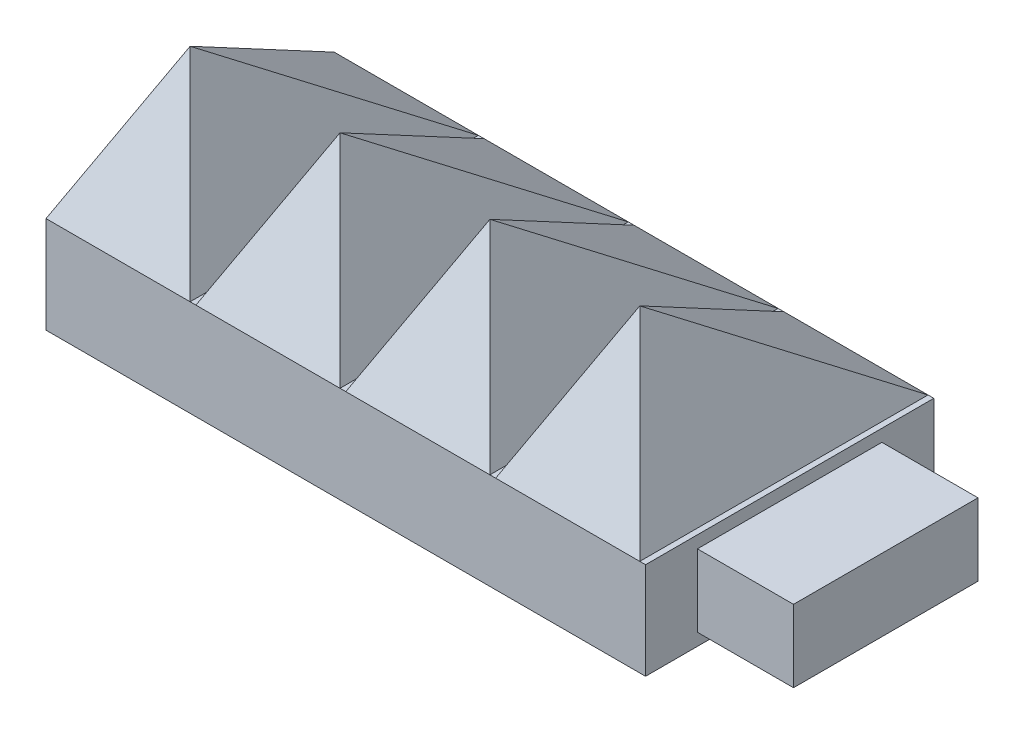
ISO-10303-21;
HEADER;
FILE_DESCRIPTION(('STEP AP214'),'2;1');
FILE_NAME('part.step','',(''),(''),'','','');
FILE_SCHEMA(('AUTOMOTIVE_DESIGN { 1 0 10303 214 1 1 1 1 }'));
ENDSEC;
DATA;
#1=APPLICATION_CONTEXT('core data for automotive mechanical design processes');
#2=APPLICATION_PROTOCOL_DEFINITION('international standard','automotive_design',2000,#1);
#3=PRODUCT_CONTEXT('',#1,'mechanical');
#4=PRODUCT('Part','Part','',(#3));
#5=PRODUCT_RELATED_PRODUCT_CATEGORY('part','',(#4));
#6=PRODUCT_DEFINITION_FORMATION('','',#4);
#7=PRODUCT_DEFINITION_CONTEXT('part definition',#1,'design');
#8=PRODUCT_DEFINITION('design','',#6,#7);
#9=PRODUCT_DEFINITION_SHAPE('','',#8);
#10=(LENGTH_UNIT() NAMED_UNIT(*) SI_UNIT(.MILLI.,.METRE.));
#11=(NAMED_UNIT(*) PLANE_ANGLE_UNIT() SI_UNIT($,.RADIAN.));
#12=(NAMED_UNIT(*) SI_UNIT($,.STERADIAN.) SOLID_ANGLE_UNIT());
#13=UNCERTAINTY_MEASURE_WITH_UNIT(LENGTH_MEASURE(1.E-05),#10,'distance_accuracy_value','');
#14=(GEOMETRIC_REPRESENTATION_CONTEXT(3) GLOBAL_UNCERTAINTY_ASSIGNED_CONTEXT((#13)) GLOBAL_UNIT_ASSIGNED_CONTEXT((#10,
#11,#12)) REPRESENTATION_CONTEXT('',''));
#15=CARTESIAN_POINT('',(0.,0.,0.));
#16=DIRECTION('',(0.,0.,1.));
#17=DIRECTION('',(1.,0.,0.));
#18=AXIS2_PLACEMENT_3D('',#15,#16,#17);
#19=CARTESIAN_POINT('',(79.248,0.,0.));
#20=DIRECTION('',(1.,0.,0.));
#21=DIRECTION('',(0.,0.,-1.));
#22=AXIS2_PLACEMENT_3D('',#19,#20,#21);
#23=PLANE('',#22);
#24=DIRECTION('',(0.,0.,-1.));
#25=VECTOR('',#24,1.);
#26=CARTESIAN_POINT('',(79.248,-6.4262,0.));
#27=LINE('',#26,#25);
#28=CARTESIAN_POINT('',(79.248,-6.4262,28.575));
#29=VERTEX_POINT('',#28);
#30=CARTESIAN_POINT('',(79.248,-6.4262,-9.525));
#31=VERTEX_POINT('',#30);
#32=EDGE_CURVE('E237',#29,#31,#27,.T.);
#33=ORIENTED_EDGE('',*,*,#32,.T.);
#34=DIRECTION('',(0.,-1.,0.));
#35=VECTOR('',#34,1.);
#36=CARTESIAN_POINT('',(79.248,6.35,-9.525));
#37=LINE('',#36,#35);
#38=CARTESIAN_POINT('',(79.248,6.35,-9.525));
#39=VERTEX_POINT('',#38);
#40=EDGE_CURVE('E226',#39,#31,#37,.T.);
#41=ORIENTED_EDGE('',*,*,#40,.F.);
#42=DIRECTION('',(0.,0.,1.));
#43=VECTOR('',#42,1.);
#44=CARTESIAN_POINT('',(79.248,6.35,-9.525));
#45=LINE('',#44,#43);
#46=CARTESIAN_POINT('',(79.248,6.34999999999999,28.575));
#47=VERTEX_POINT('',#46);
#48=EDGE_CURVE('E244',#39,#47,#45,.T.);
#49=ORIENTED_EDGE('',*,*,#48,.T.);
#50=DIRECTION('',(0.,-1.,0.));
#51=VECTOR('',#50,1.);
#52=CARTESIAN_POINT('',(79.248,6.35,28.575));
#53=LINE('',#52,#51);
#54=EDGE_CURVE('E229',#47,#29,#53,.T.);
#55=ORIENTED_EDGE('',*,*,#54,.T.);
#56=EDGE_LOOP('',(#33,#41,#49,#55));
#57=FACE_BOUND('',#56,.T.);
#58=DIRECTION('',(0.,0.,1.));
#59=VECTOR('',#58,1.);
#60=CARTESIAN_POINT('',(79.248,4.7371,21.717));
#61=LINE('',#60,#59);
#62=CARTESIAN_POINT('',(79.248,4.7371,-2.667));
#63=VERTEX_POINT('',#62);
#64=CARTESIAN_POINT('',(79.248,4.7371,21.717));
#65=VERTEX_POINT('',#64);
#66=EDGE_CURVE('E1004',#63,#65,#61,.T.);
#67=ORIENTED_EDGE('',*,*,#66,.F.);
#68=DIRECTION('',(0.,1.,0.));
#69=VECTOR('',#68,1.);
#70=CARTESIAN_POINT('',(79.248,4.7371,-2.667));
#71=LINE('',#70,#69);
#72=CARTESIAN_POINT('',(79.248,-4.8133,-2.667));
#73=VERTEX_POINT('',#72);
#74=EDGE_CURVE('E224',#73,#63,#71,.T.);
#75=ORIENTED_EDGE('',*,*,#74,.F.);
#76=DIRECTION('',(0.,0.,-1.));
#77=VECTOR('',#76,1.);
#78=CARTESIAN_POINT('',(79.248,-4.8133,21.717));
#79=LINE('',#78,#77);
#80=CARTESIAN_POINT('',(79.248,-4.8133,21.717));
#81=VERTEX_POINT('',#80);
#82=EDGE_CURVE('E220',#81,#73,#79,.T.);
#83=ORIENTED_EDGE('',*,*,#82,.F.);
#84=DIRECTION('',(0.,-1.,0.));
#85=VECTOR('',#84,1.);
#86=CARTESIAN_POINT('',(79.248,4.7371,21.717));
#87=LINE('',#86,#85);
#88=EDGE_CURVE('E1001',#65,#81,#87,.T.);
#89=ORIENTED_EDGE('',*,*,#88,.F.);
#90=EDGE_LOOP('',(#67,#75,#83,#89));
#91=FACE_BOUND('',#90,.T.);
#92=ADVANCED_FACE('F79',(#57,#91),#23,.T.);
#93=CARTESIAN_POINT('',(0.,6.35,28.575));
#94=DIRECTION('',(0.,0.,-1.));
#95=DIRECTION('',(-1.,0.,0.));
#96=AXIS2_PLACEMENT_3D('',#93,#94,#95);
#97=PLANE('',#96);
#98=ORIENTED_EDGE('',*,*,#54,.F.);
#99=DIRECTION('',(1.,0.,0.));
#100=VECTOR('',#99,1.);
#101=CARTESIAN_POINT('',(0.,6.35,28.575));
#102=LINE('',#101,#100);
#103=CARTESIAN_POINT('',(78.486,6.35,28.575));
#104=VERTEX_POINT('',#103);
#105=EDGE_CURVE('E501',#104,#47,#102,.T.);
#106=ORIENTED_EDGE('',*,*,#105,.F.);
#107=DIRECTION('',(1.,0.,0.));
#108=VECTOR('',#107,1.);
#109=CARTESIAN_POINT('',(59.436,6.35,28.575));
#110=LINE('',#109,#108);
#111=CARTESIAN_POINT('',(59.436,6.35,28.575));
#112=VERTEX_POINT('',#111);
#113=EDGE_CURVE('E320',#112,#104,#110,.T.);
#114=ORIENTED_EDGE('',*,*,#113,.F.);
#115=CARTESIAN_POINT('',(58.674,6.35,28.575));
#116=VERTEX_POINT('',#115);
#117=EDGE_CURVE('E481',#116,#112,#102,.T.);
#118=ORIENTED_EDGE('',*,*,#117,.F.);
#119=DIRECTION('',(1.,0.,0.));
#120=VECTOR('',#119,1.);
#121=CARTESIAN_POINT('',(39.624,6.35,28.575));
#122=LINE('',#121,#120);
#123=CARTESIAN_POINT('',(39.624,6.35,28.575));
#124=VERTEX_POINT('',#123);
#125=EDGE_CURVE('E370',#124,#116,#122,.T.);
#126=ORIENTED_EDGE('',*,*,#125,.F.);
#127=CARTESIAN_POINT('',(38.862,6.35,28.575));
#128=VERTEX_POINT('',#127);
#129=EDGE_CURVE('E467',#128,#124,#102,.T.);
#130=ORIENTED_EDGE('',*,*,#129,.F.);
#131=DIRECTION('',(1.,0.,0.));
#132=VECTOR('',#131,1.);
#133=CARTESIAN_POINT('',(19.812,6.35,28.575));
#134=LINE('',#133,#132);
#135=CARTESIAN_POINT('',(19.812,6.35,28.575));
#136=VERTEX_POINT('',#135);
#137=EDGE_CURVE('E457',#136,#128,#134,.T.);
#138=ORIENTED_EDGE('',*,*,#137,.F.);
#139=CARTESIAN_POINT('',(19.05,6.35,28.575));
#140=VERTEX_POINT('',#139);
#141=EDGE_CURVE('E465',#140,#136,#102,.T.);
#142=ORIENTED_EDGE('',*,*,#141,.F.);
#143=DIRECTION('',(1.,0.,0.));
#144=VECTOR('',#143,1.);
#145=CARTESIAN_POINT('',(0.,6.35,28.575));
#146=LINE('',#145,#144);
#147=CARTESIAN_POINT('',(0.,6.35,28.575));
#148=VERTEX_POINT('',#147);
#149=EDGE_CURVE('E476',#148,#140,#146,.T.);
#150=ORIENTED_EDGE('',*,*,#149,.F.);
#151=DIRECTION('',(0.,-1.,0.));
#152=VECTOR('',#151,1.);
#153=CARTESIAN_POINT('',(0.,6.35,28.575));
#154=LINE('',#153,#152);
#155=CARTESIAN_POINT('',(0.,-6.4262,28.575));
#156=VERTEX_POINT('',#155);
#157=EDGE_CURVE('E651',#148,#156,#154,.T.);
#158=ORIENTED_EDGE('',*,*,#157,.T.);
#159=DIRECTION('',(1.,0.,0.));
#160=VECTOR('',#159,1.);
#161=CARTESIAN_POINT('',(0.,-6.4262,28.575));
#162=LINE('',#161,#160);
#163=EDGE_CURVE('E646',#156,#29,#162,.T.);
#164=ORIENTED_EDGE('',*,*,#163,.T.);
#165=EDGE_LOOP('',(#98,#106,#114,#118,#126,#130,#138,#142,#150,#158,#164));
#166=FACE_BOUND('',#165,.T.);
#167=ADVANCED_FACE('F333',(#166),#97,.F.);
#168=CARTESIAN_POINT('',(0.,6.35,-9.525));
#169=DIRECTION('',(0.,0.,-1.));
#170=DIRECTION('',(-1.,0.,0.));
#171=AXIS2_PLACEMENT_3D('',#168,#169,#170);
#172=PLANE('',#171);
#173=DIRECTION('',(1.,0.,0.));
#174=VECTOR('',#173,1.);
#175=CARTESIAN_POINT('',(0.,6.35,-9.525));
#176=LINE('',#175,#174);
#177=CARTESIAN_POINT('',(78.486,6.35,-9.525));
#178=VERTEX_POINT('',#177);
#179=EDGE_CURVE('E479',#178,#39,#176,.T.);
#180=ORIENTED_EDGE('',*,*,#179,.T.);
#181=ORIENTED_EDGE('',*,*,#40,.T.);
#182=DIRECTION('',(1.,0.,0.));
#183=VECTOR('',#182,1.);
#184=CARTESIAN_POINT('',(0.,-6.4262,-9.525));
#185=LINE('',#184,#183);
#186=CARTESIAN_POINT('',(0.,-6.4262,-9.525));
#187=VERTEX_POINT('',#186);
#188=EDGE_CURVE('E490',#187,#31,#185,.T.);
#189=ORIENTED_EDGE('',*,*,#188,.F.);
#190=DIRECTION('',(0.,-1.,0.));
#191=VECTOR('',#190,1.);
#192=CARTESIAN_POINT('',(0.,6.35,-9.525));
#193=LINE('',#192,#191);
#194=CARTESIAN_POINT('',(0.,6.35,-9.525));
#195=VERTEX_POINT('',#194);
#196=EDGE_CURVE('E681',#195,#187,#193,.T.);
#197=ORIENTED_EDGE('',*,*,#196,.F.);
#198=DIRECTION('',(-1.,0.,0.));
#199=VECTOR('',#198,1.);
#200=CARTESIAN_POINT('',(0.,6.35,-9.525));
#201=LINE('',#200,#199);
#202=CARTESIAN_POINT('',(19.05,6.35,-9.525));
#203=VERTEX_POINT('',#202);
#204=EDGE_CURVE('E676',#195,#203,#201,.F.);
#205=ORIENTED_EDGE('',*,*,#204,.T.);
#206=CARTESIAN_POINT('',(19.812,6.35,-9.525));
#207=VERTEX_POINT('',#206);
#208=EDGE_CURVE('E678',#203,#207,#176,.T.);
#209=ORIENTED_EDGE('',*,*,#208,.T.);
#210=DIRECTION('',(-1.,0.,0.));
#211=VECTOR('',#210,1.);
#212=CARTESIAN_POINT('',(19.812,6.35,-9.525));
#213=LINE('',#212,#211);
#214=CARTESIAN_POINT('',(38.862,6.35,-9.525));
#215=VERTEX_POINT('',#214);
#216=EDGE_CURVE('E383',#215,#207,#213,.T.);
#217=ORIENTED_EDGE('',*,*,#216,.F.);
#218=CARTESIAN_POINT('',(39.624,6.35,-9.525));
#219=VERTEX_POINT('',#218);
#220=EDGE_CURVE('E485',#215,#219,#176,.T.);
#221=ORIENTED_EDGE('',*,*,#220,.T.);
#222=DIRECTION('',(-1.,0.,0.));
#223=VECTOR('',#222,1.);
#224=CARTESIAN_POINT('',(39.624,6.35,-9.525));
#225=LINE('',#224,#223);
#226=CARTESIAN_POINT('',(58.674,6.35,-9.525));
#227=VERTEX_POINT('',#226);
#228=EDGE_CURVE('E369',#227,#219,#225,.T.);
#229=ORIENTED_EDGE('',*,*,#228,.F.);
#230=CARTESIAN_POINT('',(59.436,6.35,-9.525));
#231=VERTEX_POINT('',#230);
#232=EDGE_CURVE('E502',#227,#231,#176,.T.);
#233=ORIENTED_EDGE('',*,*,#232,.T.);
#234=DIRECTION('',(-1.,0.,0.));
#235=VECTOR('',#234,1.);
#236=CARTESIAN_POINT('',(59.436,6.35,-9.525));
#237=LINE('',#236,#235);
#238=EDGE_CURVE('E247',#178,#231,#237,.T.);
#239=ORIENTED_EDGE('',*,*,#238,.F.);
#240=EDGE_LOOP('',(#180,#181,#189,#197,#205,#209,#217,#221,#229,#233,#239));
#241=FACE_BOUND('',#240,.T.);
#242=ADVANCED_FACE('F341',(#241),#172,.T.);
#243=CARTESIAN_POINT('',(0.,-6.4262,0.));
#244=DIRECTION('',(0.,1.,0.));
#245=DIRECTION('',(0.,0.,1.));
#246=AXIS2_PLACEMENT_3D('',#243,#244,#245);
#247=PLANE('',#246);
#248=CARTESIAN_POINT('',(38.1,-6.4262,9.52499999999998));
#249=DIRECTION('',(0.,1.,0.));
#250=DIRECTION('',(0.,0.,1.));
#251=AXIS2_PLACEMENT_3D('',#248,#249,#250);
#252=CIRCLE('',#251,12.192);
#253=CARTESIAN_POINT('',(38.1,-6.4262,21.717));
#254=VERTEX_POINT('',#253);
#255=EDGE_CURVE('E12',#254,#254,#252,.F.);
#256=ORIENTED_EDGE('',*,*,#255,.F.);
#257=EDGE_LOOP('',(#256));
#258=FACE_BOUND('',#257,.T.);
#259=ORIENTED_EDGE('',*,*,#32,.F.);
#260=ORIENTED_EDGE('',*,*,#163,.F.);
#261=DIRECTION('',(0.,0.,1.));
#262=VECTOR('',#261,1.);
#263=CARTESIAN_POINT('',(0.,-6.4262,-9.525));
#264=LINE('',#263,#262);
#265=EDGE_CURVE('E652',#187,#156,#264,.T.);
#266=ORIENTED_EDGE('',*,*,#265,.F.);
#267=ORIENTED_EDGE('',*,*,#188,.T.);
#268=EDGE_LOOP('',(#259,#260,#266,#267));
#269=FACE_BOUND('',#268,.T.);
#270=ADVANCED_FACE('F637',(#258,#269),#247,.F.);
#271=CARTESIAN_POINT('',(0.,6.35,0.));
#272=DIRECTION('',(0.,1.,0.));
#273=DIRECTION('',(0.,0.,1.));
#274=AXIS2_PLACEMENT_3D('',#271,#272,#273);
#275=PLANE('',#274);
#276=ORIENTED_EDGE('',*,*,#105,.T.);
#277=ORIENTED_EDGE('',*,*,#48,.F.);
#278=ORIENTED_EDGE('',*,*,#179,.F.);
#279=DIRECTION('',(0.,0.,-1.));
#280=VECTOR('',#279,1.);
#281=CARTESIAN_POINT('',(78.486,6.35,-9.525));
#282=LINE('',#281,#280);
#283=EDGE_CURVE('E296',#104,#178,#282,.T.);
#284=ORIENTED_EDGE('',*,*,#283,.F.);
#285=EDGE_LOOP('',(#276,#277,#278,#284));
#286=FACE_BOUND('',#285,.T.);
#287=ADVANCED_FACE('F640',(#286),#275,.T.);
#288=ORIENTED_EDGE('',*,*,#117,.T.);
#289=DIRECTION('',(0.,0.,1.));
#290=VECTOR('',#289,1.);
#291=CARTESIAN_POINT('',(59.436,6.35,-9.525));
#292=LINE('',#291,#290);
#293=EDGE_CURVE('E318',#231,#112,#292,.T.);
#294=ORIENTED_EDGE('',*,*,#293,.F.);
#295=ORIENTED_EDGE('',*,*,#232,.F.);
#296=DIRECTION('',(0.,0.,-1.));
#297=VECTOR('',#296,1.);
#298=CARTESIAN_POINT('',(58.674,6.35,-9.525));
#299=LINE('',#298,#297);
#300=EDGE_CURVE('E360',#116,#227,#299,.T.);
#301=ORIENTED_EDGE('',*,*,#300,.F.);
#302=EDGE_LOOP('',(#288,#294,#295,#301));
#303=FACE_BOUND('',#302,.T.);
#304=ADVANCED_FACE('F702',(#303),#275,.T.);
#305=ORIENTED_EDGE('',*,*,#129,.T.);
#306=DIRECTION('',(0.,0.,1.));
#307=VECTOR('',#306,1.);
#308=CARTESIAN_POINT('',(39.624,6.35,-9.525));
#309=LINE('',#308,#307);
#310=EDGE_CURVE('E518',#219,#124,#309,.T.);
#311=ORIENTED_EDGE('',*,*,#310,.F.);
#312=ORIENTED_EDGE('',*,*,#220,.F.);
#313=DIRECTION('',(0.,0.,-1.));
#314=VECTOR('',#313,1.);
#315=CARTESIAN_POINT('',(38.862,6.35,-9.525));
#316=LINE('',#315,#314);
#317=EDGE_CURVE('E435',#128,#215,#316,.T.);
#318=ORIENTED_EDGE('',*,*,#317,.F.);
#319=EDGE_LOOP('',(#305,#311,#312,#318));
#320=FACE_BOUND('',#319,.T.);
#321=ADVANCED_FACE('F721',(#320),#275,.T.);
#322=ORIENTED_EDGE('',*,*,#141,.T.);
#323=DIRECTION('',(0.,0.,1.));
#324=VECTOR('',#323,1.);
#325=CARTESIAN_POINT('',(19.812,6.35,-9.525));
#326=LINE('',#325,#324);
#327=EDGE_CURVE('E456',#207,#136,#326,.T.);
#328=ORIENTED_EDGE('',*,*,#327,.F.);
#329=ORIENTED_EDGE('',*,*,#208,.F.);
#330=DIRECTION('',(0.,0.,-1.));
#331=VECTOR('',#330,1.);
#332=CARTESIAN_POINT('',(19.05,6.35,-9.525));
#333=LINE('',#332,#331);
#334=EDGE_CURVE('E475',#140,#203,#333,.T.);
#335=ORIENTED_EDGE('',*,*,#334,.F.);
#336=EDGE_LOOP('',(#322,#328,#329,#335));
#337=FACE_BOUND('',#336,.T.);
#338=ADVANCED_FACE('F344',(#337),#275,.T.);
#339=CARTESIAN_POINT('',(0.,6.35,0.));
#340=DIRECTION('',(1.,0.,0.));
#341=DIRECTION('',(0.,0.,-1.));
#342=AXIS2_PLACEMENT_3D('',#339,#340,#341);
#343=PLANE('',#342);
#344=ORIENTED_EDGE('',*,*,#196,.T.);
#345=ORIENTED_EDGE('',*,*,#265,.T.);
#346=ORIENTED_EDGE('',*,*,#157,.F.);
#347=DIRECTION('',(0.,0.,1.));
#348=VECTOR('',#347,1.);
#349=CARTESIAN_POINT('',(0.,6.35,0.));
#350=LINE('',#349,#348);
#351=EDGE_CURVE('E88',#195,#148,#350,.T.);
#352=ORIENTED_EDGE('',*,*,#351,.F.);
#353=EDGE_LOOP('',(#344,#345,#346,#352));
#354=FACE_BOUND('',#353,.T.);
#355=ADVANCED_FACE('F81',(#354),#343,.F.);
#356=CARTESIAN_POINT('',(-2.48668262107266,1.20090918596554,0.));
#357=DIRECTION('',(0.900489002239912,-0.434878784082378,0.));
#358=DIRECTION('',(0.434878784082378,0.900489002239912,0.));
#359=AXIS2_PLACEMENT_3D('',#356,#357,#358);
#360=PLANE('',#359);
#361=DIRECTION('',(0.398800284879998,0.825782456558182,-0.398800284879998));
#362=VECTOR('',#361,1.);
#363=CARTESIAN_POINT('',(0.,6.35,28.575));
#364=LINE('',#363,#362);
#365=CARTESIAN_POINT('',(9.525,26.0731,19.05));
#366=VERTEX_POINT('',#365);
#367=EDGE_CURVE('E658',#148,#366,#364,.T.);
#368=ORIENTED_EDGE('',*,*,#367,.T.);
#369=DIRECTION('',(0.264557111265544,0.547809591727186,0.793671333796632));
#370=VECTOR('',#369,1.);
#371=CARTESIAN_POINT('',(0.,6.35,-9.525));
#372=LINE('',#371,#370);
#373=EDGE_CURVE('E661',#195,#366,#372,.T.);
#374=ORIENTED_EDGE('',*,*,#373,.F.);
#375=ORIENTED_EDGE('',*,*,#351,.T.);
#376=EDGE_LOOP('',(#368,#374,#375));
#377=FACE_BOUND('',#376,.T.);
#378=ADVANCED_FACE('F693',(#377),#360,.F.);
#379=CARTESIAN_POINT('',(0.,8.7539338084631,-6.04215964646364));
#380=DIRECTION('',(0.,-0.82299461575022,0.568049172560041));
#381=DIRECTION('',(0.,-0.568049172560041,-0.82299461575022));
#382=AXIS2_PLACEMENT_3D('',#379,#380,#381);
#383=PLANE('',#382);
#384=ORIENTED_EDGE('',*,*,#373,.T.);
#385=DIRECTION('',(-0.264557111265544,0.547809591727186,0.793671333796632));
#386=VECTOR('',#385,1.);
#387=CARTESIAN_POINT('',(19.05,6.35,-9.525));
#388=LINE('',#387,#386);
#389=EDGE_CURVE('E452',#203,#366,#388,.T.);
#390=ORIENTED_EDGE('',*,*,#389,.F.);
#391=ORIENTED_EDGE('',*,*,#204,.F.);
#392=EDGE_LOOP('',(#384,#390,#391));
#393=FACE_BOUND('',#392,.T.);
#394=ADVANCED_FACE('F674',(#393),#383,.F.);
#395=CARTESIAN_POINT('',(0.,12.3909809807925,25.6575912842277));
#396=DIRECTION('',(0.,-0.434878784082379,-0.900489002239912));
#397=DIRECTION('',(0.,0.900489002239912,-0.434878784082379));
#398=AXIS2_PLACEMENT_3D('',#395,#396,#397);
#399=PLANE('',#398);
#400=DIRECTION('',(-0.398800284879998,0.825782456558182,-0.398800284879998));
#401=VECTOR('',#400,1.);
#402=CARTESIAN_POINT('',(19.05,6.35,28.575));
#403=LINE('',#402,#401);
#404=EDGE_CURVE('E655',#140,#366,#403,.T.);
#405=ORIENTED_EDGE('',*,*,#404,.T.);
#406=ORIENTED_EDGE('',*,*,#367,.F.);
#407=ORIENTED_EDGE('',*,*,#149,.T.);
#408=EDGE_LOOP('',(#405,#406,#407));
#409=FACE_BOUND('',#408,.T.);
#410=ADVANCED_FACE('F696',(#409),#399,.F.);
#411=CARTESIAN_POINT('',(17.933955063176,8.66095704918353,0.));
#412=DIRECTION('',(-0.900489002239912,-0.434878784082379,0.));
#413=DIRECTION('',(0.434878784082379,-0.900489002239912,0.));
#414=AXIS2_PLACEMENT_3D('',#411,#412,#413);
#415=PLANE('',#414);
#416=ORIENTED_EDGE('',*,*,#389,.T.);
#417=ORIENTED_EDGE('',*,*,#404,.F.);
#418=ORIENTED_EDGE('',*,*,#334,.T.);
#419=EDGE_LOOP('',(#416,#417,#418));
#420=FACE_BOUND('',#419,.T.);
#421=ADVANCED_FACE('F671',(#420),#415,.F.);
#422=CARTESIAN_POINT('',(17.3253173789273,1.20090918596555,0.));
#423=DIRECTION('',(0.900489002239912,-0.434878784082378,0.));
#424=DIRECTION('',(0.434878784082378,0.900489002239912,0.));
#425=AXIS2_PLACEMENT_3D('',#422,#423,#424);
#426=PLANE('',#425);
#427=DIRECTION('',(0.398800284879998,0.825782456558182,-0.398800284879998));
#428=VECTOR('',#427,1.);
#429=CARTESIAN_POINT('',(19.812,6.35,28.575));
#430=LINE('',#429,#428);
#431=CARTESIAN_POINT('',(29.337,26.0731,19.05));
#432=VERTEX_POINT('',#431);
#433=EDGE_CURVE('E426',#136,#432,#430,.T.);
#434=ORIENTED_EDGE('',*,*,#433,.T.);
#435=DIRECTION('',(0.264557111265544,0.547809591727186,0.793671333796632));
#436=VECTOR('',#435,1.);
#437=CARTESIAN_POINT('',(19.812,6.35,-9.525));
#438=LINE('',#437,#436);
#439=EDGE_CURVE('E458',#207,#432,#438,.T.);
#440=ORIENTED_EDGE('',*,*,#439,.F.);
#441=ORIENTED_EDGE('',*,*,#327,.T.);
#442=EDGE_LOOP('',(#434,#440,#441));
#443=FACE_BOUND('',#442,.T.);
#444=ADVANCED_FACE('F402',(#443),#426,.F.);
#445=CARTESIAN_POINT('',(19.812,8.7539338084631,-6.04215964646364));
#446=DIRECTION('',(0.,-0.82299461575022,0.568049172560041));
#447=DIRECTION('',(0.,-0.568049172560041,-0.82299461575022));
#448=AXIS2_PLACEMENT_3D('',#445,#446,#447);
#449=PLANE('',#448);
#450=ORIENTED_EDGE('',*,*,#439,.T.);
#451=DIRECTION('',(-0.264557111265544,0.547809591727186,0.793671333796632));
#452=VECTOR('',#451,1.);
#453=CARTESIAN_POINT('',(38.862,6.35,-9.525));
#454=LINE('',#453,#452);
#455=EDGE_CURVE('E389',#215,#432,#454,.T.);
#456=ORIENTED_EDGE('',*,*,#455,.F.);
#457=ORIENTED_EDGE('',*,*,#216,.T.);
#458=EDGE_LOOP('',(#450,#456,#457));
#459=FACE_BOUND('',#458,.T.);
#460=ADVANCED_FACE('F391',(#459),#449,.F.);
#461=CARTESIAN_POINT('',(19.812,12.3909809807925,25.6575912842277));
#462=DIRECTION('',(0.,-0.434878784082379,-0.900489002239912));
#463=DIRECTION('',(0.,0.900489002239912,-0.434878784082379));
#464=AXIS2_PLACEMENT_3D('',#461,#462,#463);
#465=PLANE('',#464);
#466=DIRECTION('',(-0.398800284879998,0.825782456558182,-0.398800284879998));
#467=VECTOR('',#466,1.);
#468=CARTESIAN_POINT('',(38.862,6.35,28.575));
#469=LINE('',#468,#467);
#470=EDGE_CURVE('E418',#128,#432,#469,.T.);
#471=ORIENTED_EDGE('',*,*,#470,.T.);
#472=ORIENTED_EDGE('',*,*,#433,.F.);
#473=ORIENTED_EDGE('',*,*,#137,.T.);
#474=EDGE_LOOP('',(#471,#472,#473));
#475=FACE_BOUND('',#474,.T.);
#476=ADVANCED_FACE('F401',(#475),#465,.F.);
#477=CARTESIAN_POINT('',(37.745955063176,8.66095704918353,0.));
#478=DIRECTION('',(-0.900489002239912,-0.434878784082379,0.));
#479=DIRECTION('',(0.434878784082379,-0.900489002239912,0.));
#480=AXIS2_PLACEMENT_3D('',#477,#478,#479);
#481=PLANE('',#480);
#482=ORIENTED_EDGE('',*,*,#455,.T.);
#483=ORIENTED_EDGE('',*,*,#470,.F.);
#484=ORIENTED_EDGE('',*,*,#317,.T.);
#485=EDGE_LOOP('',(#482,#483,#484));
#486=FACE_BOUND('',#485,.T.);
#487=ADVANCED_FACE('F408',(#486),#481,.F.);
#488=CARTESIAN_POINT('',(37.1373173789273,1.20090918596555,0.));
#489=DIRECTION('',(0.900489002239912,-0.434878784082378,0.));
#490=DIRECTION('',(0.434878784082378,0.900489002239912,0.));
#491=AXIS2_PLACEMENT_3D('',#488,#489,#490);
#492=PLANE('',#491);
#493=DIRECTION('',(0.398800284879998,0.825782456558182,-0.398800284879998));
#494=VECTOR('',#493,1.);
#495=CARTESIAN_POINT('',(39.624,6.35,28.575));
#496=LINE('',#495,#494);
#497=CARTESIAN_POINT('',(49.149,26.0731,19.05));
#498=VERTEX_POINT('',#497);
#499=EDGE_CURVE('E577',#124,#498,#496,.T.);
#500=ORIENTED_EDGE('',*,*,#499,.T.);
#501=DIRECTION('',(0.264557111265544,0.547809591727186,0.793671333796632));
#502=VECTOR('',#501,1.);
#503=CARTESIAN_POINT('',(39.624,6.35,-9.525));
#504=LINE('',#503,#502);
#505=EDGE_CURVE('E583',#219,#498,#504,.T.);
#506=ORIENTED_EDGE('',*,*,#505,.F.);
#507=ORIENTED_EDGE('',*,*,#310,.T.);
#508=EDGE_LOOP('',(#500,#506,#507));
#509=FACE_BOUND('',#508,.T.);
#510=ADVANCED_FACE('F600',(#509),#492,.F.);
#511=CARTESIAN_POINT('',(39.624,8.7539338084631,-6.04215964646364));
#512=DIRECTION('',(0.,-0.82299461575022,0.568049172560041));
#513=DIRECTION('',(0.,-0.568049172560041,-0.82299461575022));
#514=AXIS2_PLACEMENT_3D('',#511,#512,#513);
#515=PLANE('',#514);
#516=ORIENTED_EDGE('',*,*,#505,.T.);
#517=DIRECTION('',(-0.264557111265544,0.547809591727186,0.793671333796632));
#518=VECTOR('',#517,1.);
#519=CARTESIAN_POINT('',(58.674,6.35,-9.525));
#520=LINE('',#519,#518);
#521=EDGE_CURVE('E313',#227,#498,#520,.T.);
#522=ORIENTED_EDGE('',*,*,#521,.F.);
#523=ORIENTED_EDGE('',*,*,#228,.T.);
#524=EDGE_LOOP('',(#516,#522,#523));
#525=FACE_BOUND('',#524,.T.);
#526=ADVANCED_FACE('F561',(#525),#515,.F.);
#527=CARTESIAN_POINT('',(39.624,12.3909809807925,25.6575912842277));
#528=DIRECTION('',(0.,-0.434878784082379,-0.900489002239912));
#529=DIRECTION('',(0.,0.900489002239912,-0.434878784082379));
#530=AXIS2_PLACEMENT_3D('',#527,#528,#529);
#531=PLANE('',#530);
#532=DIRECTION('',(-0.398800284879998,0.825782456558182,-0.398800284879998));
#533=VECTOR('',#532,1.);
#534=CARTESIAN_POINT('',(58.674,6.35,28.575));
#535=LINE('',#534,#533);
#536=EDGE_CURVE('E570',#116,#498,#535,.T.);
#537=ORIENTED_EDGE('',*,*,#536,.T.);
#538=ORIENTED_EDGE('',*,*,#499,.F.);
#539=ORIENTED_EDGE('',*,*,#125,.T.);
#540=EDGE_LOOP('',(#537,#538,#539));
#541=FACE_BOUND('',#540,.T.);
#542=ADVANCED_FACE('F556',(#541),#531,.F.);
#543=CARTESIAN_POINT('',(57.557955063176,8.66095704918353,0.));
#544=DIRECTION('',(-0.900489002239912,-0.434878784082379,0.));
#545=DIRECTION('',(0.434878784082379,-0.900489002239912,0.));
#546=AXIS2_PLACEMENT_3D('',#543,#544,#545);
#547=PLANE('',#546);
#548=ORIENTED_EDGE('',*,*,#521,.T.);
#549=ORIENTED_EDGE('',*,*,#536,.F.);
#550=ORIENTED_EDGE('',*,*,#300,.T.);
#551=EDGE_LOOP('',(#548,#549,#550));
#552=FACE_BOUND('',#551,.T.);
#553=ADVANCED_FACE('F547',(#552),#547,.F.);
#554=CARTESIAN_POINT('',(56.9493173789273,1.20090918596555,0.));
#555=DIRECTION('',(0.900489002239912,-0.434878784082378,0.));
#556=DIRECTION('',(0.434878784082378,0.900489002239912,0.));
#557=AXIS2_PLACEMENT_3D('',#554,#555,#556);
#558=PLANE('',#557);
#559=DIRECTION('',(0.398800284879998,0.825782456558182,-0.398800284879998));
#560=VECTOR('',#559,1.);
#561=CARTESIAN_POINT('',(59.436,6.35,28.575));
#562=LINE('',#561,#560);
#563=CARTESIAN_POINT('',(68.961,26.0731,19.05));
#564=VERTEX_POINT('',#563);
#565=EDGE_CURVE('E289',#112,#564,#562,.T.);
#566=ORIENTED_EDGE('',*,*,#565,.T.);
#567=DIRECTION('',(0.264557111265544,0.547809591727186,0.793671333796632));
#568=VECTOR('',#567,1.);
#569=CARTESIAN_POINT('',(59.436,6.35,-9.525));
#570=LINE('',#569,#568);
#571=EDGE_CURVE('E321',#231,#564,#570,.T.);
#572=ORIENTED_EDGE('',*,*,#571,.F.);
#573=ORIENTED_EDGE('',*,*,#293,.T.);
#574=EDGE_LOOP('',(#566,#572,#573));
#575=FACE_BOUND('',#574,.T.);
#576=ADVANCED_FACE('F265',(#575),#558,.F.);
#577=CARTESIAN_POINT('',(59.436,8.7539338084631,-6.04215964646364));
#578=DIRECTION('',(0.,-0.82299461575022,0.568049172560041));
#579=DIRECTION('',(0.,-0.568049172560041,-0.82299461575022));
#580=AXIS2_PLACEMENT_3D('',#577,#578,#579);
#581=PLANE('',#580);
#582=ORIENTED_EDGE('',*,*,#571,.T.);
#583=DIRECTION('',(-0.264557111265544,0.547809591727186,0.793671333796632));
#584=VECTOR('',#583,1.);
#585=CARTESIAN_POINT('',(78.486,6.35,-9.525));
#586=LINE('',#585,#584);
#587=EDGE_CURVE('E104',#178,#564,#586,.T.);
#588=ORIENTED_EDGE('',*,*,#587,.F.);
#589=ORIENTED_EDGE('',*,*,#238,.T.);
#590=EDGE_LOOP('',(#582,#588,#589));
#591=FACE_BOUND('',#590,.T.);
#592=ADVANCED_FACE('F254',(#591),#581,.F.);
#593=CARTESIAN_POINT('',(59.436,12.3909809807925,25.6575912842277));
#594=DIRECTION('',(0.,-0.434878784082379,-0.900489002239912));
#595=DIRECTION('',(0.,0.900489002239912,-0.434878784082379));
#596=AXIS2_PLACEMENT_3D('',#593,#594,#595);
#597=PLANE('',#596);
#598=DIRECTION('',(-0.398800284879998,0.825782456558182,-0.398800284879998));
#599=VECTOR('',#598,1.);
#600=CARTESIAN_POINT('',(78.486,6.35,28.575));
#601=LINE('',#600,#599);
#602=EDGE_CURVE('E281',#104,#564,#601,.T.);
#603=ORIENTED_EDGE('',*,*,#602,.T.);
#604=ORIENTED_EDGE('',*,*,#565,.F.);
#605=ORIENTED_EDGE('',*,*,#113,.T.);
#606=EDGE_LOOP('',(#603,#604,#605));
#607=FACE_BOUND('',#606,.T.);
#608=ADVANCED_FACE('F264',(#607),#597,.F.);
#609=CARTESIAN_POINT('',(77.369955063176,8.66095704918353,0.));
#610=DIRECTION('',(-0.900489002239912,-0.434878784082379,0.));
#611=DIRECTION('',(0.434878784082379,-0.900489002239912,0.));
#612=AXIS2_PLACEMENT_3D('',#609,#610,#611);
#613=PLANE('',#612);
#614=ORIENTED_EDGE('',*,*,#587,.T.);
#615=ORIENTED_EDGE('',*,*,#602,.F.);
#616=ORIENTED_EDGE('',*,*,#283,.T.);
#617=EDGE_LOOP('',(#614,#615,#616));
#618=FACE_BOUND('',#617,.T.);
#619=ADVANCED_FACE('F271',(#618),#613,.F.);
#620=CARTESIAN_POINT('',(38.1,-12.7762,9.52499999999998));
#621=DIRECTION('',(0.,1.,0.));
#622=DIRECTION('',(0.,0.,1.));
#623=AXIS2_PLACEMENT_3D('',#620,#621,#622);
#624=CYLINDRICAL_SURFACE('',#623,12.192);
#625=CARTESIAN_POINT('',(38.1,-12.7762,9.52499999999998));
#626=DIRECTION('',(0.,-1.,0.));
#627=DIRECTION('',(0.,0.,-1.));
#628=AXIS2_PLACEMENT_3D('',#625,#626,#627);
#629=CIRCLE('',#628,12.192);
#630=CARTESIAN_POINT('',(38.1,-12.7762,-2.66700000000003));
#631=VERTEX_POINT('',#630);
#632=EDGE_CURVE('E241',#631,#631,#629,.T.);
#633=ORIENTED_EDGE('',*,*,#632,.F.);
#634=EDGE_LOOP('',(#633));
#635=FACE_BOUND('',#634,.T.);
#636=ORIENTED_EDGE('',*,*,#255,.T.);
#637=EDGE_LOOP('',(#636));
#638=FACE_BOUND('',#637,.T.);
#639=ADVANCED_FACE('F626',(#635,#638),#624,.T.);
#640=CARTESIAN_POINT('',(38.1,-12.7762,9.52499999999998));
#641=DIRECTION('',(0.,-1.,0.));
#642=DIRECTION('',(0.,0.,-1.));
#643=AXIS2_PLACEMENT_3D('',#640,#641,#642);
#644=PLANE('',#643);
#645=ORIENTED_EDGE('',*,*,#632,.T.);
#646=EDGE_LOOP('',(#645));
#647=FACE_BOUND('',#646,.T.);
#648=ADVANCED_FACE('F624',(#647),#644,.T.);
#649=CARTESIAN_POINT('',(91.948,4.7371,-2.667));
#650=DIRECTION('',(0.,0.,1.));
#651=DIRECTION('',(0.,-1.,0.));
#652=AXIS2_PLACEMENT_3D('',#649,#650,#651);
#653=PLANE('',#652);
#654=ORIENTED_EDGE('',*,*,#74,.T.);
#655=DIRECTION('',(-1.,0.,0.));
#656=VECTOR('',#655,1.);
#657=CARTESIAN_POINT('',(91.948,4.7371,-2.667));
#658=LINE('',#657,#656);
#659=CARTESIAN_POINT('',(91.948,4.7371,-2.667));
#660=VERTEX_POINT('',#659);
#661=EDGE_CURVE('E205',#660,#63,#658,.T.);
#662=ORIENTED_EDGE('',*,*,#661,.F.);
#663=DIRECTION('',(0.,1.,0.));
#664=VECTOR('',#663,1.);
#665=CARTESIAN_POINT('',(91.948,4.7371,-2.667));
#666=LINE('',#665,#664);
#667=CARTESIAN_POINT('',(91.948,-4.8133,-2.667));
#668=VERTEX_POINT('',#667);
#669=EDGE_CURVE('E212',#668,#660,#666,.T.);
#670=ORIENTED_EDGE('',*,*,#669,.F.);
#671=DIRECTION('',(-1.,0.,0.));
#672=VECTOR('',#671,1.);
#673=CARTESIAN_POINT('',(91.948,-4.8133,-2.667));
#674=LINE('',#673,#672);
#675=EDGE_CURVE('E999',#668,#73,#674,.T.);
#676=ORIENTED_EDGE('',*,*,#675,.T.);
#677=EDGE_LOOP('',(#654,#662,#670,#676));
#678=FACE_BOUND('',#677,.T.);
#679=ADVANCED_FACE('F222',(#678),#653,.F.);
#680=CARTESIAN_POINT('',(91.948,4.7371,21.717));
#681=DIRECTION('',(0.,-1.,0.));
#682=DIRECTION('',(0.,0.,-1.));
#683=AXIS2_PLACEMENT_3D('',#680,#681,#682);
#684=PLANE('',#683);
#685=ORIENTED_EDGE('',*,*,#66,.T.);
#686=DIRECTION('',(-1.,0.,0.));
#687=VECTOR('',#686,1.);
#688=CARTESIAN_POINT('',(91.948,4.7371,21.717));
#689=LINE('',#688,#687);
#690=CARTESIAN_POINT('',(91.948,4.7371,21.717));
#691=VERTEX_POINT('',#690);
#692=EDGE_CURVE('E208',#691,#65,#689,.T.);
#693=ORIENTED_EDGE('',*,*,#692,.F.);
#694=DIRECTION('',(0.,0.,1.));
#695=VECTOR('',#694,1.);
#696=CARTESIAN_POINT('',(91.948,4.7371,21.717));
#697=LINE('',#696,#695);
#698=EDGE_CURVE('E201',#660,#691,#697,.T.);
#699=ORIENTED_EDGE('',*,*,#698,.F.);
#700=ORIENTED_EDGE('',*,*,#661,.T.);
#701=EDGE_LOOP('',(#685,#693,#699,#700));
#702=FACE_BOUND('',#701,.T.);
#703=ADVANCED_FACE('F203',(#702),#684,.F.);
#704=CARTESIAN_POINT('',(91.948,4.7371,21.717));
#705=DIRECTION('',(0.,0.,-1.));
#706=DIRECTION('',(-1.,0.,0.));
#707=AXIS2_PLACEMENT_3D('',#704,#705,#706);
#708=PLANE('',#707);
#709=ORIENTED_EDGE('',*,*,#88,.T.);
#710=DIRECTION('',(-1.,0.,0.));
#711=VECTOR('',#710,1.);
#712=CARTESIAN_POINT('',(91.948,-4.8133,21.717));
#713=LINE('',#712,#711);
#714=CARTESIAN_POINT('',(91.948,-4.8133,21.717));
#715=VERTEX_POINT('',#714);
#716=EDGE_CURVE('E96',#715,#81,#713,.T.);
#717=ORIENTED_EDGE('',*,*,#716,.F.);
#718=DIRECTION('',(0.,-1.,0.));
#719=VECTOR('',#718,1.);
#720=CARTESIAN_POINT('',(91.948,4.7371,21.717));
#721=LINE('',#720,#719);
#722=EDGE_CURVE('E211',#691,#715,#721,.T.);
#723=ORIENTED_EDGE('',*,*,#722,.F.);
#724=ORIENTED_EDGE('',*,*,#692,.T.);
#725=EDGE_LOOP('',(#709,#717,#723,#724));
#726=FACE_BOUND('',#725,.T.);
#727=ADVANCED_FACE('F966',(#726),#708,.F.);
#728=CARTESIAN_POINT('',(91.948,-4.8133,21.717));
#729=DIRECTION('',(0.,1.,0.));
#730=DIRECTION('',(0.,0.,1.));
#731=AXIS2_PLACEMENT_3D('',#728,#729,#730);
#732=PLANE('',#731);
#733=ORIENTED_EDGE('',*,*,#82,.T.);
#734=ORIENTED_EDGE('',*,*,#675,.F.);
#735=DIRECTION('',(0.,0.,-1.));
#736=VECTOR('',#735,1.);
#737=CARTESIAN_POINT('',(91.948,-4.8133,21.717));
#738=LINE('',#737,#736);
#739=EDGE_CURVE('E216',#715,#668,#738,.T.);
#740=ORIENTED_EDGE('',*,*,#739,.F.);
#741=ORIENTED_EDGE('',*,*,#716,.T.);
#742=EDGE_LOOP('',(#733,#734,#740,#741));
#743=FACE_BOUND('',#742,.T.);
#744=ADVANCED_FACE('F972',(#743),#732,.F.);
#745=CARTESIAN_POINT('',(91.948,0.,0.));
#746=DIRECTION('',(1.,0.,0.));
#747=DIRECTION('',(0.,0.,-1.));
#748=AXIS2_PLACEMENT_3D('',#745,#746,#747);
#749=PLANE('',#748);
#750=ORIENTED_EDGE('',*,*,#669,.T.);
#751=ORIENTED_EDGE('',*,*,#698,.T.);
#752=ORIENTED_EDGE('',*,*,#722,.T.);
#753=ORIENTED_EDGE('',*,*,#739,.T.);
#754=EDGE_LOOP('',(#750,#751,#752,#753));
#755=FACE_BOUND('',#754,.T.);
#756=ADVANCED_FACE('F215',(#755),#749,.T.);
#757=CLOSED_SHELL('',(#92,#167,#242,#270,#287,#304,#321,#338,#355,#378,#394,#410,#421,#444,#460,
#476,#487,#510,#526,#542,#553,#576,#592,#608,#619,#639,#648,#679,#703,#727,#744,#756));
#758=MANIFOLD_SOLID_BREP('B2',#757);
#759=ADVANCED_BREP_SHAPE_REPRESENTATION('',(#18,#758),#14);
#760=SHAPE_DEFINITION_REPRESENTATION(#9,#759);
ENDSEC;
END-ISO-10303-21;
